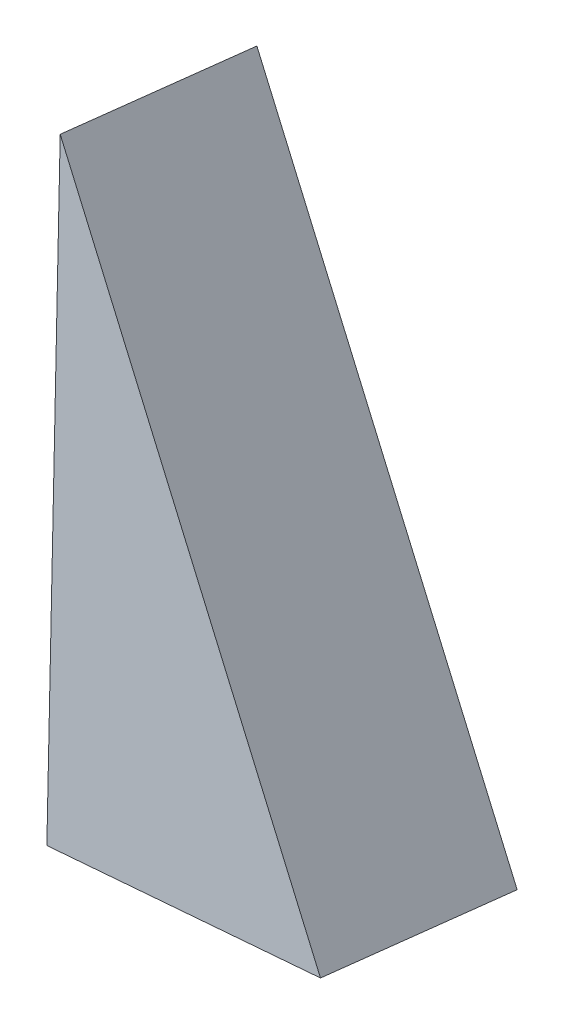
ISO-10303-21;
HEADER;
FILE_DESCRIPTION(('STEP AP214'),'2;1');
FILE_NAME('part.step','',(''),(''),'','','');
FILE_SCHEMA(('AUTOMOTIVE_DESIGN { 1 0 10303 214 1 1 1 1 }'));
ENDSEC;
DATA;
#1=APPLICATION_CONTEXT('core data for automotive mechanical design processes');
#2=APPLICATION_PROTOCOL_DEFINITION('international standard','automotive_design',2000,#1);
#3=PRODUCT_CONTEXT('',#1,'mechanical');
#4=PRODUCT('Part','Part','',(#3));
#5=PRODUCT_RELATED_PRODUCT_CATEGORY('part','',(#4));
#6=PRODUCT_DEFINITION_FORMATION('','',#4);
#7=PRODUCT_DEFINITION_CONTEXT('part definition',#1,'design');
#8=PRODUCT_DEFINITION('design','',#6,#7);
#9=PRODUCT_DEFINITION_SHAPE('','',#8);
#10=(LENGTH_UNIT() NAMED_UNIT(*) SI_UNIT(.MILLI.,.METRE.));
#11=(NAMED_UNIT(*) PLANE_ANGLE_UNIT() SI_UNIT($,.RADIAN.));
#12=(NAMED_UNIT(*) SI_UNIT($,.STERADIAN.) SOLID_ANGLE_UNIT());
#13=UNCERTAINTY_MEASURE_WITH_UNIT(LENGTH_MEASURE(1.E-05),#10,'distance_accuracy_value','');
#14=(GEOMETRIC_REPRESENTATION_CONTEXT(3) GLOBAL_UNCERTAINTY_ASSIGNED_CONTEXT((#13)) GLOBAL_UNIT_ASSIGNED_CONTEXT((#10,
#11,#12)) REPRESENTATION_CONTEXT('',''));
#15=CARTESIAN_POINT('',(0.,0.,0.));
#16=DIRECTION('',(0.,0.,1.));
#17=DIRECTION('',(1.,0.,0.));
#18=AXIS2_PLACEMENT_3D('',#15,#16,#17);
#19=CARTESIAN_POINT('',(12.5414811966188,31.0315846757315,287.310575273421));
#20=DIRECTION('',(0.996751437956792,0.0805392508722798,0.));
#21=DIRECTION('',(-0.080106036720292,0.991389992149182,-0.103580434192044));
#22=AXIS2_PLACEMENT_3D('',#19,#20,#21);
#23=PLANE('',#22);
#24=DIRECTION('',(0.00834229057485176,-0.103243946725109,-0.994621080438469));
#25=VECTOR('',#24,1.);
#26=CARTESIAN_POINT('',(-0.80440550491667,196.199892258567,270.053789195616));
#27=LINE('',#26,#25);
#28=CARTESIAN_POINT('',(-0.887828410665187,197.232331725818,280.));
#29=VERTEX_POINT('',#28);
#30=CARTESIAN_POINT('',(-0.80440550491667,196.199892258567,270.053789195616));
#31=VERTEX_POINT('',#30);
#32=EDGE_CURVE('E11',#29,#31,#27,.T.);
#33=ORIENTED_EDGE('',*,*,#32,.F.);
#34=DIRECTION('',(-0.080106036720292,0.991389992149182,-0.103580434192044));
#35=VECTOR('',#34,1.);
#36=CARTESIAN_POINT('',(12.4580582908703,32.0640241429826,297.256786077805));
#37=LINE('',#36,#35);
#38=CARTESIAN_POINT('',(-3.21090347555366,225.982641498144,276.996167408431));
#39=VERTEX_POINT('',#38);
#40=EDGE_CURVE('E81',#29,#39,#37,.T.);
#41=ORIENTED_EDGE('',*,*,#40,.T.);
#42=DIRECTION('',(0.00834229057485176,-0.103243946725109,-0.994621080438469));
#43=VECTOR('',#42,1.);
#44=CARTESIAN_POINT('',(-3.12748056980514,224.950202030893,267.049956604046));
#45=LINE('',#44,#43);
#46=CARTESIAN_POINT('',(-3.12748056980514,224.950202030893,267.049956604046));
#47=VERTEX_POINT('',#46);
#48=EDGE_CURVE('E47',#39,#47,#45,.T.);
#49=ORIENTED_EDGE('',*,*,#48,.T.);
#50=DIRECTION('',(-0.080106036720292,0.991389992149182,-0.103580434192044));
#51=VECTOR('',#50,1.);
#52=CARTESIAN_POINT('',(12.5414811966188,31.0315846757315,287.310575273421));
#53=LINE('',#52,#51);
#54=EDGE_CURVE('E76',#31,#47,#53,.T.);
#55=ORIENTED_EDGE('',*,*,#54,.F.);
#56=EDGE_LOOP('',(#33,#41,#49,#55));
#57=FACE_BOUND('',#56,.T.);
#58=ADVANCED_FACE('F37',(#57),#23,.F.);
#59=CARTESIAN_POINT('',(82.616047123727,79.445114776009,282.872883756133));
#60=DIRECTION('',(-0.862800113869152,-0.503535627125841,0.0450314970033795));
#61=DIRECTION('',(0.505476378968735,-0.857783515625947,0.0932795295069986));
#62=AXIS2_PLACEMENT_3D('',#59,#60,#61);
#63=PLANE('',#62);
#64=ORIENTED_EDGE('',*,*,#48,.F.);
#65=DIRECTION('',(0.505476378968735,-0.857783515625947,0.0932795295069986));
#66=VECTOR('',#65,1.);
#67=CARTESIAN_POINT('',(82.5326242179784,80.4775542432601,292.819094560518));
#68=LINE('',#67,#66);
#69=CARTESIAN_POINT('',(13.0666917207299,198.35988123803,280.));
#70=VERTEX_POINT('',#69);
#71=EDGE_CURVE('E80',#39,#70,#68,.T.);
#72=ORIENTED_EDGE('',*,*,#71,.T.);
#73=DIRECTION('',(0.00834229057485176,-0.103243946725109,-0.994621080438469));
#74=VECTOR('',#73,1.);
#75=CARTESIAN_POINT('',(13.1501146264784,197.327441770779,270.053789195616));
#76=LINE('',#75,#74);
#77=CARTESIAN_POINT('',(13.1501146264784,197.327441770779,270.053789195616));
#78=VERTEX_POINT('',#77);
#79=EDGE_CURVE('E41',#70,#78,#76,.T.);
#80=ORIENTED_EDGE('',*,*,#79,.T.);
#81=DIRECTION('',(0.505476378968735,-0.857783515625947,0.0932795295069986));
#82=VECTOR('',#81,1.);
#83=CARTESIAN_POINT('',(82.616047123727,79.445114776009,282.872883756133));
#84=LINE('',#83,#82);
#85=EDGE_CURVE('E88',#47,#78,#84,.T.);
#86=ORIENTED_EDGE('',*,*,#85,.F.);
#87=EDGE_LOOP('',(#64,#72,#80,#86));
#88=FACE_BOUND('',#87,.T.);
#89=ADVANCED_FACE('F83',(#88),#63,.F.);
#90=CARTESIAN_POINT('',(-15.755677074268,194.991803495483,270.053789195616));
#91=DIRECTION('',(-0.0801060367202844,0.991389992149183,-0.103580434192044));
#92=DIRECTION('',(-0.996751437956792,-0.0805392508722723,0.));
#93=AXIS2_PLACEMENT_3D('',#90,#91,#92);
#94=PLANE('',#93);
#95=DIRECTION('',(-0.996751437956792,-0.0805392508722723,0.));
#96=VECTOR('',#95,1.);
#97=CARTESIAN_POINT('',(-15.8390999800165,196.024242962734,280.));
#98=LINE('',#97,#96);
#99=EDGE_CURVE('E69',#70,#29,#98,.T.);
#100=ORIENTED_EDGE('',*,*,#99,.T.);
#101=ORIENTED_EDGE('',*,*,#32,.T.);
#102=DIRECTION('',(-0.996751437956792,-0.0805392508722723,0.));
#103=VECTOR('',#102,1.);
#104=CARTESIAN_POINT('',(-15.755677074268,194.991803495483,270.053789195616));
#105=LINE('',#104,#103);
#106=EDGE_CURVE('E72',#78,#31,#105,.T.);
#107=ORIENTED_EDGE('',*,*,#106,.F.);
#108=ORIENTED_EDGE('',*,*,#79,.F.);
#109=EDGE_LOOP('',(#100,#101,#107,#108));
#110=FACE_BOUND('',#109,.T.);
#111=ADVANCED_FACE('F39',(#110),#94,.F.);
#112=CARTESIAN_POINT('',(-2.40979037273378,29.8234959126472,287.310575273421));
#113=DIRECTION('',(-0.00834229057485176,0.103243946725109,0.994621080438469));
#114=DIRECTION('',(0.,-0.994655691981301,0.103247539482546));
#115=AXIS2_PLACEMENT_3D('',#112,#113,#114);
#116=PLANE('',#115);
#117=ORIENTED_EDGE('',*,*,#85,.T.);
#118=ORIENTED_EDGE('',*,*,#106,.T.);
#119=ORIENTED_EDGE('',*,*,#54,.T.);
#120=EDGE_LOOP('',(#117,#118,#119));
#121=FACE_BOUND('',#120,.T.);
#122=ADVANCED_FACE('F93',(#121),#116,.F.);
#123=CARTESIAN_POINT('',(-2.4932132784823,30.8559353798983,297.256786077805));
#124=DIRECTION('',(-0.00834229057485176,0.103243946725109,0.994621080438469));
#125=DIRECTION('',(0.,-0.994655691981301,0.103247539482546));
#126=AXIS2_PLACEMENT_3D('',#123,#124,#125);
#127=PLANE('',#126);
#128=ORIENTED_EDGE('',*,*,#71,.F.);
#129=ORIENTED_EDGE('',*,*,#40,.F.);
#130=ORIENTED_EDGE('',*,*,#99,.F.);
#131=EDGE_LOOP('',(#128,#129,#130));
#132=FACE_BOUND('',#131,.T.);
#133=ADVANCED_FACE('F79',(#132),#127,.T.);
#134=CLOSED_SHELL('',(#58,#89,#111,#122,#133));
#135=MANIFOLD_SOLID_BREP('B2',#134);
#136=ADVANCED_BREP_SHAPE_REPRESENTATION('',(#18,#135),#14);
#137=SHAPE_DEFINITION_REPRESENTATION(#9,#136);
ENDSEC;
END-ISO-10303-21;
